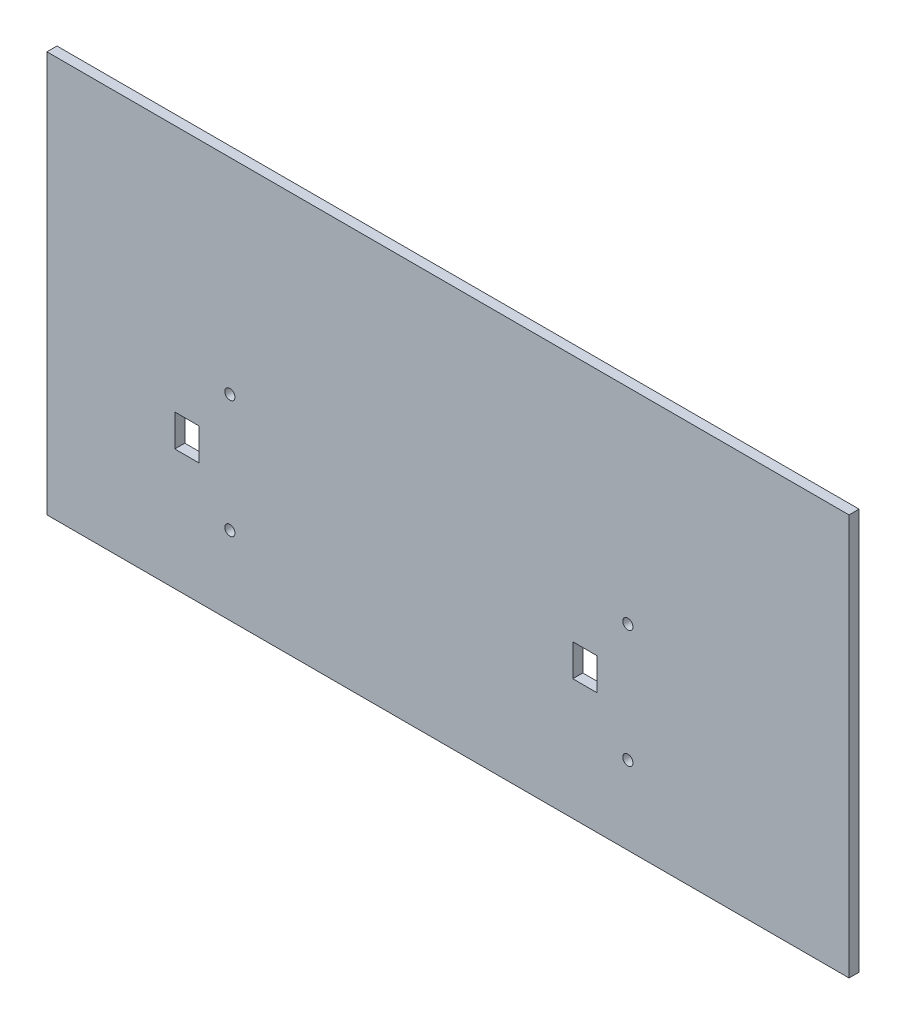
ISO-10303-21;
HEADER;
FILE_DESCRIPTION(('STEP AP214'),'2;1');
FILE_NAME('part.step','',(''),(''),'','','');
FILE_SCHEMA(('AUTOMOTIVE_DESIGN { 1 0 10303 214 1 1 1 1 }'));
ENDSEC;
DATA;
#1=APPLICATION_CONTEXT('core data for automotive mechanical design processes');
#2=APPLICATION_PROTOCOL_DEFINITION('international standard','automotive_design',2000,#1);
#3=PRODUCT_CONTEXT('',#1,'mechanical');
#4=PRODUCT('Part','Part','',(#3));
#5=PRODUCT_RELATED_PRODUCT_CATEGORY('part','',(#4));
#6=PRODUCT_DEFINITION_FORMATION('','',#4);
#7=PRODUCT_DEFINITION_CONTEXT('part definition',#1,'design');
#8=PRODUCT_DEFINITION('design','',#6,#7);
#9=PRODUCT_DEFINITION_SHAPE('','',#8);
#10=(LENGTH_UNIT() NAMED_UNIT(*) SI_UNIT(.MILLI.,.METRE.));
#11=(NAMED_UNIT(*) PLANE_ANGLE_UNIT() SI_UNIT($,.RADIAN.));
#12=(NAMED_UNIT(*) SI_UNIT($,.STERADIAN.) SOLID_ANGLE_UNIT());
#13=UNCERTAINTY_MEASURE_WITH_UNIT(LENGTH_MEASURE(1.E-05),#10,'distance_accuracy_value','');
#14=(GEOMETRIC_REPRESENTATION_CONTEXT(3) GLOBAL_UNCERTAINTY_ASSIGNED_CONTEXT((#13)) GLOBAL_UNIT_ASSIGNED_CONTEXT((#10,
#11,#12)) REPRESENTATION_CONTEXT('',''));
#15=CARTESIAN_POINT('',(0.,0.,0.));
#16=DIRECTION('',(0.,0.,1.));
#17=DIRECTION('',(1.,0.,0.));
#18=AXIS2_PLACEMENT_3D('',#15,#16,#17);
#19=CARTESIAN_POINT('',(127.,-63.5,1.5875));
#20=DIRECTION('',(-1.,0.,0.));
#21=DIRECTION('',(0.,0.,1.));
#22=AXIS2_PLACEMENT_3D('',#19,#20,#21);
#23=PLANE('',#22);
#24=DIRECTION('',(0.,1.,0.));
#25=VECTOR('',#24,1.);
#26=CARTESIAN_POINT('',(127.,-63.5,-1.5875));
#27=LINE('',#26,#25);
#28=CARTESIAN_POINT('',(127.,-63.5,-1.5875));
#29=VERTEX_POINT('',#28);
#30=CARTESIAN_POINT('',(127.,63.5,-1.5875));
#31=VERTEX_POINT('',#30);
#32=EDGE_CURVE('E215',#29,#31,#27,.T.);
#33=ORIENTED_EDGE('',*,*,#32,.T.);
#34=DIRECTION('',(0.,0.,-1.));
#35=VECTOR('',#34,1.);
#36=CARTESIAN_POINT('',(127.,63.5,1.5875));
#37=LINE('',#36,#35);
#38=CARTESIAN_POINT('',(127.,63.5,1.5875));
#39=VERTEX_POINT('',#38);
#40=EDGE_CURVE('E11',#39,#31,#37,.T.);
#41=ORIENTED_EDGE('',*,*,#40,.F.);
#42=DIRECTION('',(0.,1.,0.));
#43=VECTOR('',#42,1.);
#44=CARTESIAN_POINT('',(127.,-63.5,1.5875));
#45=LINE('',#44,#43);
#46=CARTESIAN_POINT('',(127.,-63.5,1.5875));
#47=VERTEX_POINT('',#46);
#48=EDGE_CURVE('E216',#47,#39,#45,.T.);
#49=ORIENTED_EDGE('',*,*,#48,.F.);
#50=DIRECTION('',(0.,0.,-1.));
#51=VECTOR('',#50,1.);
#52=CARTESIAN_POINT('',(127.,-63.5,1.5875));
#53=LINE('',#52,#51);
#54=EDGE_CURVE('E226',#47,#29,#53,.T.);
#55=ORIENTED_EDGE('',*,*,#54,.T.);
#56=EDGE_LOOP('',(#33,#41,#49,#55));
#57=FACE_BOUND('',#56,.T.);
#58=ADVANCED_FACE('F33',(#57),#23,.F.);
#59=CARTESIAN_POINT('',(-127.,63.5,1.5875));
#60=DIRECTION('',(0.,-1.,0.));
#61=DIRECTION('',(0.,0.,-1.));
#62=AXIS2_PLACEMENT_3D('',#59,#60,#61);
#63=PLANE('',#62);
#64=DIRECTION('',(-1.,0.,0.));
#65=VECTOR('',#64,1.);
#66=CARTESIAN_POINT('',(-127.,63.5,-1.5875));
#67=LINE('',#66,#65);
#68=CARTESIAN_POINT('',(-127.,63.5,-1.5875));
#69=VERTEX_POINT('',#68);
#70=EDGE_CURVE('E229',#31,#69,#67,.T.);
#71=ORIENTED_EDGE('',*,*,#70,.T.);
#72=DIRECTION('',(0.,0.,-1.));
#73=VECTOR('',#72,1.);
#74=CARTESIAN_POINT('',(-127.,63.5,1.5875));
#75=LINE('',#74,#73);
#76=CARTESIAN_POINT('',(-127.,63.5,1.5875));
#77=VERTEX_POINT('',#76);
#78=EDGE_CURVE('E40',#77,#69,#75,.T.);
#79=ORIENTED_EDGE('',*,*,#78,.F.);
#80=DIRECTION('',(-1.,0.,0.));
#81=VECTOR('',#80,1.);
#82=CARTESIAN_POINT('',(-127.,63.5,1.5875));
#83=LINE('',#82,#81);
#84=EDGE_CURVE('E219',#39,#77,#83,.T.);
#85=ORIENTED_EDGE('',*,*,#84,.F.);
#86=ORIENTED_EDGE('',*,*,#40,.T.);
#87=EDGE_LOOP('',(#71,#79,#85,#86));
#88=FACE_BOUND('',#87,.T.);
#89=ADVANCED_FACE('F258',(#88),#63,.F.);
#90=CARTESIAN_POINT('',(-127.,-63.5,1.5875));
#91=DIRECTION('',(1.,0.,0.));
#92=DIRECTION('',(0.,0.,-1.));
#93=AXIS2_PLACEMENT_3D('',#90,#91,#92);
#94=PLANE('',#93);
#95=DIRECTION('',(0.,-1.,0.));
#96=VECTOR('',#95,1.);
#97=CARTESIAN_POINT('',(-127.,-63.5,-1.5875));
#98=LINE('',#97,#96);
#99=CARTESIAN_POINT('',(-127.,-63.5,-1.5875));
#100=VERTEX_POINT('',#99);
#101=EDGE_CURVE('E231',#69,#100,#98,.T.);
#102=ORIENTED_EDGE('',*,*,#101,.T.);
#103=DIRECTION('',(0.,0.,-1.));
#104=VECTOR('',#103,1.);
#105=CARTESIAN_POINT('',(-127.,-63.5,1.5875));
#106=LINE('',#105,#104);
#107=CARTESIAN_POINT('',(-127.,-63.5,1.5875));
#108=VERTEX_POINT('',#107);
#109=EDGE_CURVE('E236',#108,#100,#106,.T.);
#110=ORIENTED_EDGE('',*,*,#109,.F.);
#111=DIRECTION('',(0.,-1.,0.));
#112=VECTOR('',#111,1.);
#113=CARTESIAN_POINT('',(-127.,-63.5,1.5875));
#114=LINE('',#113,#112);
#115=EDGE_CURVE('E222',#77,#108,#114,.T.);
#116=ORIENTED_EDGE('',*,*,#115,.F.);
#117=ORIENTED_EDGE('',*,*,#78,.T.);
#118=EDGE_LOOP('',(#102,#110,#116,#117));
#119=FACE_BOUND('',#118,.T.);
#120=ADVANCED_FACE('F243',(#119),#94,.F.);
#121=CARTESIAN_POINT('',(-127.,-63.5,1.5875));
#122=DIRECTION('',(0.,1.,0.));
#123=DIRECTION('',(0.,0.,1.));
#124=AXIS2_PLACEMENT_3D('',#121,#122,#123);
#125=PLANE('',#124);
#126=DIRECTION('',(1.,0.,0.));
#127=VECTOR('',#126,1.);
#128=CARTESIAN_POINT('',(-127.,-63.5,-1.5875));
#129=LINE('',#128,#127);
#130=EDGE_CURVE('E220',#100,#29,#129,.T.);
#131=ORIENTED_EDGE('',*,*,#130,.T.);
#132=ORIENTED_EDGE('',*,*,#54,.F.);
#133=DIRECTION('',(1.,0.,0.));
#134=VECTOR('',#133,1.);
#135=CARTESIAN_POINT('',(-127.,-63.5,1.5875));
#136=LINE('',#135,#134);
#137=EDGE_CURVE('E224',#108,#47,#136,.T.);
#138=ORIENTED_EDGE('',*,*,#137,.F.);
#139=ORIENTED_EDGE('',*,*,#109,.T.);
#140=EDGE_LOOP('',(#131,#132,#138,#139));
#141=FACE_BOUND('',#140,.T.);
#142=ADVANCED_FACE('F251',(#141),#125,.F.);
#143=CARTESIAN_POINT('',(0.,0.,1.5875));
#144=DIRECTION('',(0.,0.,-1.));
#145=DIRECTION('',(-1.,0.,0.));
#146=AXIS2_PLACEMENT_3D('',#143,#144,#145);
#147=PLANE('',#146);
#148=CARTESIAN_POINT('',(56.9550000089999,-38.74,1.5875));
#149=DIRECTION('',(0.,0.,-1.));
#150=DIRECTION('',(-1.,0.,0.));
#151=AXIS2_PLACEMENT_3D('',#148,#149,#150);
#152=CIRCLE('',#151,1.61);
#153=CARTESIAN_POINT('',(55.3450000089999,-38.74,1.5875));
#154=VERTEX_POINT('',#153);
#155=EDGE_CURVE('E212',#154,#154,#152,.T.);
#156=ORIENTED_EDGE('',*,*,#155,.T.);
#157=EDGE_LOOP('',(#156));
#158=FACE_BOUND('',#157,.T.);
#159=CARTESIAN_POINT('',(-69.0694646860126,-38.74,1.5875));
#160=DIRECTION('',(0.,0.,-1.));
#161=DIRECTION('',(-1.,0.,0.));
#162=AXIS2_PLACEMENT_3D('',#159,#160,#161);
#163=CIRCLE('',#162,1.61);
#164=CARTESIAN_POINT('',(-70.6794646860126,-38.74,1.5875));
#165=VERTEX_POINT('',#164);
#166=EDGE_CURVE('E209',#165,#165,#163,.T.);
#167=ORIENTED_EDGE('',*,*,#166,.T.);
#168=EDGE_LOOP('',(#167));
#169=FACE_BOUND('',#168,.T.);
#170=CARTESIAN_POINT('',(-69.0694646860126,-1.46000000000006,1.5875));
#171=DIRECTION('',(0.,0.,-1.));
#172=DIRECTION('',(-1.,0.,0.));
#173=AXIS2_PLACEMENT_3D('',#170,#171,#172);
#174=CIRCLE('',#173,1.61);
#175=CARTESIAN_POINT('',(-70.6794646860126,-1.46000000000006,1.5875));
#176=VERTEX_POINT('',#175);
#177=EDGE_CURVE('E206',#176,#176,#174,.T.);
#178=ORIENTED_EDGE('',*,*,#177,.T.);
#179=EDGE_LOOP('',(#178));
#180=FACE_BOUND('',#179,.T.);
#181=DIRECTION('',(0.,1.,0.));
#182=VECTOR('',#181,1.);
#183=CARTESIAN_POINT('',(-86.5144646770126,0.,1.5875));
#184=LINE('',#183,#182);
#185=CARTESIAN_POINT('',(-86.5144646770126,-25.175,1.5875));
#186=VERTEX_POINT('',#185);
#187=CARTESIAN_POINT('',(-86.5144646770126,-15.025,1.5875));
#188=VERTEX_POINT('',#187);
#189=EDGE_CURVE('E200',#186,#188,#184,.T.);
#190=ORIENTED_EDGE('',*,*,#189,.T.);
#191=DIRECTION('',(1.,0.,0.));
#192=VECTOR('',#191,1.);
#193=CARTESIAN_POINT('',(0.,-15.025,1.5875));
#194=LINE('',#193,#192);
#195=CARTESIAN_POINT('',(-78.8944646770126,-15.025,1.5875));
#196=VERTEX_POINT('',#195);
#197=EDGE_CURVE('E203',#188,#196,#194,.T.);
#198=ORIENTED_EDGE('',*,*,#197,.T.);
#199=DIRECTION('',(0.,-1.,0.));
#200=VECTOR('',#199,1.);
#201=CARTESIAN_POINT('',(-78.8944646770126,0.,1.5875));
#202=LINE('',#201,#200);
#203=CARTESIAN_POINT('',(-78.8944646770126,-25.175,1.5875));
#204=VERTEX_POINT('',#203);
#205=EDGE_CURVE('E194',#196,#204,#202,.T.);
#206=ORIENTED_EDGE('',*,*,#205,.T.);
#207=DIRECTION('',(-1.,0.,0.));
#208=VECTOR('',#207,1.);
#209=CARTESIAN_POINT('',(0.,-25.1750000000001,1.5875));
#210=LINE('',#209,#208);
#211=EDGE_CURVE('E197',#204,#186,#210,.T.);
#212=ORIENTED_EDGE('',*,*,#211,.T.);
#213=EDGE_LOOP('',(#190,#198,#206,#212));
#214=FACE_BOUND('',#213,.T.);
#215=DIRECTION('',(0.,1.,0.));
#216=VECTOR('',#215,1.);
#217=CARTESIAN_POINT('',(39.5100000179999,0.,1.5875));
#218=LINE('',#217,#216);
#219=CARTESIAN_POINT('',(39.5100000179999,-25.175,1.5875));
#220=VERTEX_POINT('',#219);
#221=CARTESIAN_POINT('',(39.5100000179999,-15.025,1.5875));
#222=VERTEX_POINT('',#221);
#223=EDGE_CURVE('E188',#220,#222,#218,.T.);
#224=ORIENTED_EDGE('',*,*,#223,.T.);
#225=DIRECTION('',(1.,0.,0.));
#226=VECTOR('',#225,1.);
#227=CARTESIAN_POINT('',(0.,-15.025,1.5875));
#228=LINE('',#227,#226);
#229=CARTESIAN_POINT('',(47.1300000179999,-15.025,1.5875));
#230=VERTEX_POINT('',#229);
#231=EDGE_CURVE('E191',#222,#230,#228,.T.);
#232=ORIENTED_EDGE('',*,*,#231,.T.);
#233=DIRECTION('',(0.,-1.,0.));
#234=VECTOR('',#233,1.);
#235=CARTESIAN_POINT('',(47.1300000179999,0.,1.5875));
#236=LINE('',#235,#234);
#237=CARTESIAN_POINT('',(47.1300000179999,-25.175,1.5875));
#238=VERTEX_POINT('',#237);
#239=EDGE_CURVE('E185',#230,#238,#236,.T.);
#240=ORIENTED_EDGE('',*,*,#239,.T.);
#241=DIRECTION('',(-1.,0.,0.));
#242=VECTOR('',#241,1.);
#243=CARTESIAN_POINT('',(0.,-25.175,1.5875));
#244=LINE('',#243,#242);
#245=EDGE_CURVE('E126',#238,#220,#244,.T.);
#246=ORIENTED_EDGE('',*,*,#245,.T.);
#247=EDGE_LOOP('',(#224,#232,#240,#246));
#248=FACE_BOUND('',#247,.T.);
#249=CARTESIAN_POINT('',(56.9550000089999,-1.46000000000001,1.5875));
#250=DIRECTION('',(0.,0.,-1.));
#251=DIRECTION('',(-1.,0.,0.));
#252=AXIS2_PLACEMENT_3D('',#249,#250,#251);
#253=CIRCLE('',#252,1.61);
#254=CARTESIAN_POINT('',(55.3450000089999,-1.46000000000001,1.5875));
#255=VERTEX_POINT('',#254);
#256=EDGE_CURVE('E182',#255,#255,#253,.T.);
#257=ORIENTED_EDGE('',*,*,#256,.T.);
#258=EDGE_LOOP('',(#257));
#259=FACE_BOUND('',#258,.T.);
#260=ORIENTED_EDGE('',*,*,#48,.T.);
#261=ORIENTED_EDGE('',*,*,#84,.T.);
#262=ORIENTED_EDGE('',*,*,#115,.T.);
#263=ORIENTED_EDGE('',*,*,#137,.T.);
#264=EDGE_LOOP('',(#260,#261,#262,#263));
#265=FACE_BOUND('',#264,.T.);
#266=ADVANCED_FACE('F257',(#158,#169,#180,#214,#248,#259,#265),#147,.F.);
#267=CARTESIAN_POINT('',(0.,0.,-1.5875));
#268=DIRECTION('',(0.,0.,-1.));
#269=DIRECTION('',(-1.,0.,0.));
#270=AXIS2_PLACEMENT_3D('',#267,#268,#269);
#271=PLANE('',#270);
#272=CARTESIAN_POINT('',(56.9550000089999,-38.74,-1.5875));
#273=DIRECTION('',(0.,0.,-1.));
#274=DIRECTION('',(-1.,0.,0.));
#275=AXIS2_PLACEMENT_3D('',#272,#273,#274);
#276=CIRCLE('',#275,1.61);
#277=CARTESIAN_POINT('',(55.3450000089999,-38.74,-1.5875));
#278=VERTEX_POINT('',#277);
#279=EDGE_CURVE('E153',#278,#278,#276,.T.);
#280=ORIENTED_EDGE('',*,*,#279,.F.);
#281=EDGE_LOOP('',(#280));
#282=FACE_BOUND('',#281,.T.);
#283=CARTESIAN_POINT('',(-69.0694646860126,-38.74,-1.5875));
#284=DIRECTION('',(0.,0.,-1.));
#285=DIRECTION('',(-1.,0.,0.));
#286=AXIS2_PLACEMENT_3D('',#283,#284,#285);
#287=CIRCLE('',#286,1.61);
#288=CARTESIAN_POINT('',(-70.6794646860126,-38.74,-1.5875));
#289=VERTEX_POINT('',#288);
#290=EDGE_CURVE('E157',#289,#289,#287,.T.);
#291=ORIENTED_EDGE('',*,*,#290,.F.);
#292=EDGE_LOOP('',(#291));
#293=FACE_BOUND('',#292,.T.);
#294=CARTESIAN_POINT('',(-69.0694646860126,-1.46000000000006,-1.5875));
#295=DIRECTION('',(0.,0.,-1.));
#296=DIRECTION('',(-1.,0.,0.));
#297=AXIS2_PLACEMENT_3D('',#294,#295,#296);
#298=CIRCLE('',#297,1.61);
#299=CARTESIAN_POINT('',(-70.6794646860126,-1.46000000000006,-1.5875));
#300=VERTEX_POINT('',#299);
#301=EDGE_CURVE('E160',#300,#300,#298,.T.);
#302=ORIENTED_EDGE('',*,*,#301,.F.);
#303=EDGE_LOOP('',(#302));
#304=FACE_BOUND('',#303,.T.);
#305=DIRECTION('',(1.,0.,0.));
#306=VECTOR('',#305,1.);
#307=CARTESIAN_POINT('',(-78.8944646770126,-15.025,-1.5875));
#308=LINE('',#307,#306);
#309=CARTESIAN_POINT('',(-86.5144646770126,-15.025,-1.5875));
#310=VERTEX_POINT('',#309);
#311=CARTESIAN_POINT('',(-78.8944646770126,-15.025,-1.5875));
#312=VERTEX_POINT('',#311);
#313=EDGE_CURVE('E150',#310,#312,#308,.T.);
#314=ORIENTED_EDGE('',*,*,#313,.F.);
#315=DIRECTION('',(0.,1.,0.));
#316=VECTOR('',#315,1.);
#317=CARTESIAN_POINT('',(-86.5144646770126,-15.025,-1.5875));
#318=LINE('',#317,#316);
#319=CARTESIAN_POINT('',(-86.5144646770126,-25.175,-1.5875));
#320=VERTEX_POINT('',#319);
#321=EDGE_CURVE('E170',#320,#310,#318,.T.);
#322=ORIENTED_EDGE('',*,*,#321,.F.);
#323=DIRECTION('',(-1.,0.,0.));
#324=VECTOR('',#323,1.);
#325=CARTESIAN_POINT('',(-78.8944646770126,-25.175,-1.5875));
#326=LINE('',#325,#324);
#327=CARTESIAN_POINT('',(-78.8944646770126,-25.175,-1.5875));
#328=VERTEX_POINT('',#327);
#329=EDGE_CURVE('E167',#328,#320,#326,.T.);
#330=ORIENTED_EDGE('',*,*,#329,.F.);
#331=DIRECTION('',(0.,-1.,0.));
#332=VECTOR('',#331,1.);
#333=CARTESIAN_POINT('',(-78.8944646770126,-15.025,-1.5875));
#334=LINE('',#333,#332);
#335=EDGE_CURVE('E165',#312,#328,#334,.T.);
#336=ORIENTED_EDGE('',*,*,#335,.F.);
#337=EDGE_LOOP('',(#314,#322,#330,#336));
#338=FACE_BOUND('',#337,.T.);
#339=DIRECTION('',(1.,0.,0.));
#340=VECTOR('',#339,1.);
#341=CARTESIAN_POINT('',(47.1300000179999,-15.025,-1.5875));
#342=LINE('',#341,#340);
#343=CARTESIAN_POINT('',(39.5100000179999,-15.025,-1.5875));
#344=VERTEX_POINT('',#343);
#345=CARTESIAN_POINT('',(47.1300000179999,-15.025,-1.5875));
#346=VERTEX_POINT('',#345);
#347=EDGE_CURVE('E138',#344,#346,#342,.T.);
#348=ORIENTED_EDGE('',*,*,#347,.F.);
#349=DIRECTION('',(0.,1.,0.));
#350=VECTOR('',#349,1.);
#351=CARTESIAN_POINT('',(39.5100000179999,-15.025,-1.5875));
#352=LINE('',#351,#350);
#353=CARTESIAN_POINT('',(39.5100000179999,-25.175,-1.5875));
#354=VERTEX_POINT('',#353);
#355=EDGE_CURVE('E143',#354,#344,#352,.T.);
#356=ORIENTED_EDGE('',*,*,#355,.F.);
#357=DIRECTION('',(-1.,0.,0.));
#358=VECTOR('',#357,1.);
#359=CARTESIAN_POINT('',(47.1300000179999,-25.175,-1.5875));
#360=LINE('',#359,#358);
#361=CARTESIAN_POINT('',(47.1300000179999,-25.175,-1.5875));
#362=VERTEX_POINT('',#361);
#363=EDGE_CURVE('E123',#362,#354,#360,.T.);
#364=ORIENTED_EDGE('',*,*,#363,.F.);
#365=DIRECTION('',(0.,-1.,0.));
#366=VECTOR('',#365,1.);
#367=CARTESIAN_POINT('',(47.1300000179999,-15.025,-1.5875));
#368=LINE('',#367,#366);
#369=EDGE_CURVE('E133',#346,#362,#368,.T.);
#370=ORIENTED_EDGE('',*,*,#369,.F.);
#371=EDGE_LOOP('',(#348,#356,#364,#370));
#372=FACE_BOUND('',#371,.T.);
#373=CARTESIAN_POINT('',(56.9550000089999,-1.46000000000001,-1.5875));
#374=DIRECTION('',(0.,0.,-1.));
#375=DIRECTION('',(-1.,0.,0.));
#376=AXIS2_PLACEMENT_3D('',#373,#374,#375);
#377=CIRCLE('',#376,1.61);
#378=CARTESIAN_POINT('',(55.3450000089999,-1.46000000000001,-1.5875));
#379=VERTEX_POINT('',#378);
#380=EDGE_CURVE('E156',#379,#379,#377,.T.);
#381=ORIENTED_EDGE('',*,*,#380,.F.);
#382=EDGE_LOOP('',(#381));
#383=FACE_BOUND('',#382,.T.);
#384=ORIENTED_EDGE('',*,*,#32,.F.);
#385=ORIENTED_EDGE('',*,*,#130,.F.);
#386=ORIENTED_EDGE('',*,*,#101,.F.);
#387=ORIENTED_EDGE('',*,*,#70,.F.);
#388=EDGE_LOOP('',(#384,#385,#386,#387));
#389=FACE_BOUND('',#388,.T.);
#390=ADVANCED_FACE('F140',(#282,#293,#304,#338,#372,#383,#389),#271,.T.);
#391=CARTESIAN_POINT('',(56.9550000089999,-1.46000000000001,3.4925));
#392=DIRECTION('',(0.,0.,-1.));
#393=DIRECTION('',(-1.,0.,0.));
#394=AXIS2_PLACEMENT_3D('',#391,#392,#393);
#395=CYLINDRICAL_SURFACE('',#394,1.61);
#396=ORIENTED_EDGE('',*,*,#380,.T.);
#397=EDGE_LOOP('',(#396));
#398=FACE_BOUND('',#397,.T.);
#399=ORIENTED_EDGE('',*,*,#256,.F.);
#400=EDGE_LOOP('',(#399));
#401=FACE_BOUND('',#400,.T.);
#402=ADVANCED_FACE('F270',(#398,#401),#395,.F.);
#403=CARTESIAN_POINT('',(47.1300000179999,-15.025,3.4925));
#404=DIRECTION('',(0.,1.,0.));
#405=DIRECTION('',(-1.,0.,0.));
#406=AXIS2_PLACEMENT_3D('',#403,#404,#405);
#407=PLANE('',#406);
#408=DIRECTION('',(0.,0.,-1.));
#409=VECTOR('',#408,1.);
#410=CARTESIAN_POINT('',(39.5100000179999,-15.025,3.4925));
#411=LINE('',#410,#409);
#412=EDGE_CURVE('E148',#222,#344,#411,.T.);
#413=ORIENTED_EDGE('',*,*,#412,.T.);
#414=ORIENTED_EDGE('',*,*,#347,.T.);
#415=DIRECTION('',(0.,0.,-1.));
#416=VECTOR('',#415,1.);
#417=CARTESIAN_POINT('',(47.1300000179999,-15.025,3.4925));
#418=LINE('',#417,#416);
#419=EDGE_CURVE('E129',#230,#346,#418,.T.);
#420=ORIENTED_EDGE('',*,*,#419,.F.);
#421=ORIENTED_EDGE('',*,*,#231,.F.);
#422=EDGE_LOOP('',(#413,#414,#420,#421));
#423=FACE_BOUND('',#422,.T.);
#424=ADVANCED_FACE('F277',(#423),#407,.F.);
#425=CARTESIAN_POINT('',(39.5100000179999,-15.025,3.4925));
#426=DIRECTION('',(-1.,0.,0.));
#427=DIRECTION('',(0.,-1.,0.));
#428=AXIS2_PLACEMENT_3D('',#425,#426,#427);
#429=PLANE('',#428);
#430=DIRECTION('',(0.,0.,-1.));
#431=VECTOR('',#430,1.);
#432=CARTESIAN_POINT('',(39.5100000179999,-25.175,3.4925));
#433=LINE('',#432,#431);
#434=EDGE_CURVE('E128',#220,#354,#433,.T.);
#435=ORIENTED_EDGE('',*,*,#434,.T.);
#436=ORIENTED_EDGE('',*,*,#355,.T.);
#437=ORIENTED_EDGE('',*,*,#412,.F.);
#438=ORIENTED_EDGE('',*,*,#223,.F.);
#439=EDGE_LOOP('',(#435,#436,#437,#438));
#440=FACE_BOUND('',#439,.T.);
#441=ADVANCED_FACE('F308',(#440),#429,.F.);
#442=CARTESIAN_POINT('',(47.1300000179999,-25.175,3.4925));
#443=DIRECTION('',(0.,-1.,0.));
#444=DIRECTION('',(0.,0.,-1.));
#445=AXIS2_PLACEMENT_3D('',#442,#443,#444);
#446=PLANE('',#445);
#447=DIRECTION('',(0.,0.,-1.));
#448=VECTOR('',#447,1.);
#449=CARTESIAN_POINT('',(47.1300000179999,-25.175,3.4925));
#450=LINE('',#449,#448);
#451=EDGE_CURVE('E55',#238,#362,#450,.T.);
#452=ORIENTED_EDGE('',*,*,#451,.T.);
#453=ORIENTED_EDGE('',*,*,#363,.T.);
#454=ORIENTED_EDGE('',*,*,#434,.F.);
#455=ORIENTED_EDGE('',*,*,#245,.F.);
#456=EDGE_LOOP('',(#452,#453,#454,#455));
#457=FACE_BOUND('',#456,.T.);
#458=ADVANCED_FACE('F120',(#457),#446,.F.);
#459=CARTESIAN_POINT('',(47.1300000179999,-15.025,3.4925));
#460=DIRECTION('',(1.,0.,0.));
#461=DIRECTION('',(0.,0.,-1.));
#462=AXIS2_PLACEMENT_3D('',#459,#460,#461);
#463=PLANE('',#462);
#464=ORIENTED_EDGE('',*,*,#419,.T.);
#465=ORIENTED_EDGE('',*,*,#369,.T.);
#466=ORIENTED_EDGE('',*,*,#451,.F.);
#467=ORIENTED_EDGE('',*,*,#239,.F.);
#468=EDGE_LOOP('',(#464,#465,#466,#467));
#469=FACE_BOUND('',#468,.T.);
#470=ADVANCED_FACE('F134',(#469),#463,.F.);
#471=CARTESIAN_POINT('',(-78.8944646770126,-15.025,3.4925));
#472=DIRECTION('',(0.,1.,0.));
#473=DIRECTION('',(-1.,0.,0.));
#474=AXIS2_PLACEMENT_3D('',#471,#472,#473);
#475=PLANE('',#474);
#476=DIRECTION('',(0.,0.,-1.));
#477=VECTOR('',#476,1.);
#478=CARTESIAN_POINT('',(-86.5144646770126,-15.025,3.4925));
#479=LINE('',#478,#477);
#480=EDGE_CURVE('E163',#188,#310,#479,.T.);
#481=ORIENTED_EDGE('',*,*,#480,.T.);
#482=ORIENTED_EDGE('',*,*,#313,.T.);
#483=DIRECTION('',(0.,0.,-1.));
#484=VECTOR('',#483,1.);
#485=CARTESIAN_POINT('',(-78.8944646770126,-15.025,3.4925));
#486=LINE('',#485,#484);
#487=EDGE_CURVE('E173',#196,#312,#486,.T.);
#488=ORIENTED_EDGE('',*,*,#487,.F.);
#489=ORIENTED_EDGE('',*,*,#197,.F.);
#490=EDGE_LOOP('',(#481,#482,#488,#489));
#491=FACE_BOUND('',#490,.T.);
#492=ADVANCED_FACE('F279',(#491),#475,.F.);
#493=CARTESIAN_POINT('',(-86.5144646770126,-15.025,3.4925));
#494=DIRECTION('',(-1.,0.,0.));
#495=DIRECTION('',(0.,0.,1.));
#496=AXIS2_PLACEMENT_3D('',#493,#494,#495);
#497=PLANE('',#496);
#498=DIRECTION('',(0.,0.,-1.));
#499=VECTOR('',#498,1.);
#500=CARTESIAN_POINT('',(-86.5144646770126,-25.175,3.4925));
#501=LINE('',#500,#499);
#502=EDGE_CURVE('E175',#186,#320,#501,.T.);
#503=ORIENTED_EDGE('',*,*,#502,.T.);
#504=ORIENTED_EDGE('',*,*,#321,.T.);
#505=ORIENTED_EDGE('',*,*,#480,.F.);
#506=ORIENTED_EDGE('',*,*,#189,.F.);
#507=EDGE_LOOP('',(#503,#504,#505,#506));
#508=FACE_BOUND('',#507,.T.);
#509=ADVANCED_FACE('F282',(#508),#497,.F.);
#510=CARTESIAN_POINT('',(-78.8944646770126,-25.175,3.4925));
#511=DIRECTION('',(0.,-1.,0.));
#512=DIRECTION('',(1.,0.,0.));
#513=AXIS2_PLACEMENT_3D('',#510,#511,#512);
#514=PLANE('',#513);
#515=DIRECTION('',(0.,0.,-1.));
#516=VECTOR('',#515,1.);
#517=CARTESIAN_POINT('',(-78.8944646770126,-25.175,3.4925));
#518=LINE('',#517,#516);
#519=EDGE_CURVE('E47',#204,#328,#518,.T.);
#520=ORIENTED_EDGE('',*,*,#519,.T.);
#521=ORIENTED_EDGE('',*,*,#329,.T.);
#522=ORIENTED_EDGE('',*,*,#502,.F.);
#523=ORIENTED_EDGE('',*,*,#211,.F.);
#524=EDGE_LOOP('',(#520,#521,#522,#523));
#525=FACE_BOUND('',#524,.T.);
#526=ADVANCED_FACE('F288',(#525),#514,.F.);
#527=CARTESIAN_POINT('',(-78.8944646770126,-15.025,3.4925));
#528=DIRECTION('',(1.,0.,0.));
#529=DIRECTION('',(0.,0.,-1.));
#530=AXIS2_PLACEMENT_3D('',#527,#528,#529);
#531=PLANE('',#530);
#532=ORIENTED_EDGE('',*,*,#487,.T.);
#533=ORIENTED_EDGE('',*,*,#335,.T.);
#534=ORIENTED_EDGE('',*,*,#519,.F.);
#535=ORIENTED_EDGE('',*,*,#205,.F.);
#536=EDGE_LOOP('',(#532,#533,#534,#535));
#537=FACE_BOUND('',#536,.T.);
#538=ADVANCED_FACE('F284',(#537),#531,.F.);
#539=CARTESIAN_POINT('',(-69.0694646860126,-1.46000000000006,3.4925));
#540=DIRECTION('',(0.,0.,-1.));
#541=DIRECTION('',(-1.,0.,0.));
#542=AXIS2_PLACEMENT_3D('',#539,#540,#541);
#543=CYLINDRICAL_SURFACE('',#542,1.61);
#544=ORIENTED_EDGE('',*,*,#301,.T.);
#545=EDGE_LOOP('',(#544));
#546=FACE_BOUND('',#545,.T.);
#547=ORIENTED_EDGE('',*,*,#177,.F.);
#548=EDGE_LOOP('',(#547));
#549=FACE_BOUND('',#548,.T.);
#550=ADVANCED_FACE('F287',(#546,#549),#543,.F.);
#551=CARTESIAN_POINT('',(-69.0694646860126,-38.74,3.4925));
#552=DIRECTION('',(0.,0.,-1.));
#553=DIRECTION('',(-1.,0.,0.));
#554=AXIS2_PLACEMENT_3D('',#551,#552,#553);
#555=CYLINDRICAL_SURFACE('',#554,1.61);
#556=ORIENTED_EDGE('',*,*,#290,.T.);
#557=EDGE_LOOP('',(#556));
#558=FACE_BOUND('',#557,.T.);
#559=ORIENTED_EDGE('',*,*,#166,.F.);
#560=EDGE_LOOP('',(#559));
#561=FACE_BOUND('',#560,.T.);
#562=ADVANCED_FACE('F297',(#558,#561),#555,.F.);
#563=CARTESIAN_POINT('',(56.9550000089999,-38.74,3.4925));
#564=DIRECTION('',(0.,0.,-1.));
#565=DIRECTION('',(-1.,0.,0.));
#566=AXIS2_PLACEMENT_3D('',#563,#564,#565);
#567=CYLINDRICAL_SURFACE('',#566,1.61);
#568=ORIENTED_EDGE('',*,*,#279,.T.);
#569=EDGE_LOOP('',(#568));
#570=FACE_BOUND('',#569,.T.);
#571=ORIENTED_EDGE('',*,*,#155,.F.);
#572=EDGE_LOOP('',(#571));
#573=FACE_BOUND('',#572,.T.);
#574=ADVANCED_FACE('F301',(#570,#573),#567,.F.);
#575=CLOSED_SHELL('',(#58,#89,#120,#142,#266,#390,#402,#424,#441,#458,#470,#492,#509,#526,#538,
#550,#562,#574));
#576=MANIFOLD_SOLID_BREP('B2',#575);
#577=ADVANCED_BREP_SHAPE_REPRESENTATION('',(#18,#576),#14);
#578=SHAPE_DEFINITION_REPRESENTATION(#9,#577);
ENDSEC;
END-ISO-10303-21;
